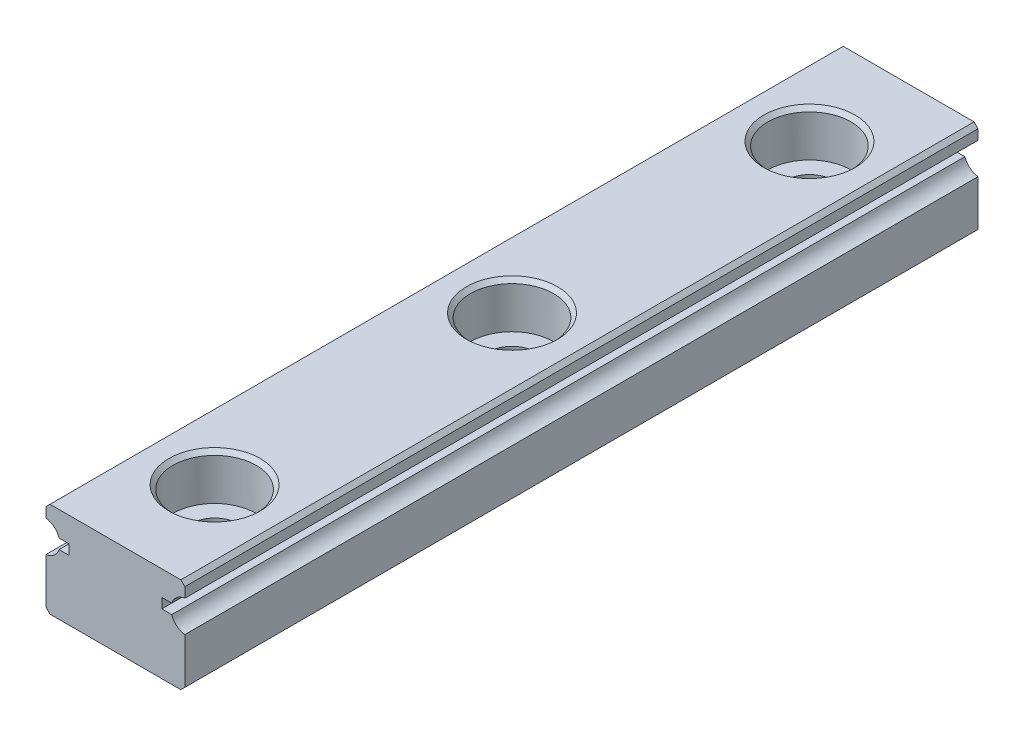
ISO-10303-21;
HEADER;
FILE_DESCRIPTION(('STEP AP214'),'2;1');
FILE_NAME('part.step','',(''),(''),'','','');
FILE_SCHEMA(('AUTOMOTIVE_DESIGN { 1 0 10303 214 1 1 1 1 }'));
ENDSEC;
DATA;
#1=APPLICATION_CONTEXT('core data for automotive mechanical design processes');
#2=APPLICATION_PROTOCOL_DEFINITION('international standard','automotive_design',2000,#1);
#3=PRODUCT_CONTEXT('',#1,'mechanical');
#4=PRODUCT('Part','Part','',(#3));
#5=PRODUCT_RELATED_PRODUCT_CATEGORY('part','',(#4));
#6=PRODUCT_DEFINITION_FORMATION('','',#4);
#7=PRODUCT_DEFINITION_CONTEXT('part definition',#1,'design');
#8=PRODUCT_DEFINITION('design','',#6,#7);
#9=PRODUCT_DEFINITION_SHAPE('','',#8);
#10=(LENGTH_UNIT() NAMED_UNIT(*) SI_UNIT(.MILLI.,.METRE.));
#11=(NAMED_UNIT(*) PLANE_ANGLE_UNIT() SI_UNIT($,.RADIAN.));
#12=(NAMED_UNIT(*) SI_UNIT($,.STERADIAN.) SOLID_ANGLE_UNIT());
#13=UNCERTAINTY_MEASURE_WITH_UNIT(LENGTH_MEASURE(1.E-05),#10,'distance_accuracy_value','');
#14=(GEOMETRIC_REPRESENTATION_CONTEXT(3) GLOBAL_UNCERTAINTY_ASSIGNED_CONTEXT((#13)) GLOBAL_UNIT_ASSIGNED_CONTEXT((#10,
#11,#12)) REPRESENTATION_CONTEXT('',''));
#15=CARTESIAN_POINT('',(0.,0.,0.));
#16=DIRECTION('',(0.,0.,1.));
#17=DIRECTION('',(1.,0.,0.));
#18=AXIS2_PLACEMENT_3D('',#15,#16,#17);
#19=CARTESIAN_POINT('',(0.,-2.401,35.));
#20=DIRECTION('',(0.,1.,0.));
#21=DIRECTION('',(0.,0.,1.));
#22=AXIS2_PLACEMENT_3D('',#19,#20,#21);
#23=CYLINDRICAL_SURFACE('',#22,1.2);
#24=CARTESIAN_POINT('',(0.,-2.20000000000001,35.));
#25=DIRECTION('',(0.,1.,0.));
#26=DIRECTION('',(0.,0.,1.));
#27=AXIS2_PLACEMENT_3D('',#24,#25,#26);
#28=CIRCLE('',#27,1.2);
#29=CARTESIAN_POINT('',(0.,-2.20000000000001,36.2));
#30=VERTEX_POINT('',#29);
#31=EDGE_CURVE('E318',#30,#30,#28,.F.);
#32=ORIENTED_EDGE('',*,*,#31,.T.);
#33=EDGE_LOOP('',(#32));
#34=FACE_BOUND('',#33,.T.);
#35=CARTESIAN_POINT('',(0.,0.0999999999999994,35.));
#36=DIRECTION('',(0.,1.,0.));
#37=DIRECTION('',(0.,0.,1.));
#38=AXIS2_PLACEMENT_3D('',#35,#36,#37);
#39=CIRCLE('',#38,1.2);
#40=CARTESIAN_POINT('',(0.,0.0999999999999994,36.2));
#41=VERTEX_POINT('',#40);
#42=EDGE_CURVE('E566',#41,#41,#39,.T.);
#43=ORIENTED_EDGE('',*,*,#42,.T.);
#44=EDGE_LOOP('',(#43));
#45=FACE_BOUND('',#44,.T.);
#46=ADVANCED_FACE('F34',(#34,#45),#23,.F.);
#47=CARTESIAN_POINT('',(0.,-2.401,20.));
#48=DIRECTION('',(0.,1.,0.));
#49=DIRECTION('',(0.,0.,1.));
#50=AXIS2_PLACEMENT_3D('',#47,#48,#49);
#51=CYLINDRICAL_SURFACE('',#50,1.2);
#52=CARTESIAN_POINT('',(0.,-2.20000000000001,20.));
#53=DIRECTION('',(0.,1.,0.));
#54=DIRECTION('',(0.,0.,1.));
#55=AXIS2_PLACEMENT_3D('',#52,#53,#54);
#56=CIRCLE('',#55,1.2);
#57=CARTESIAN_POINT('',(0.,-2.20000000000001,21.2));
#58=VERTEX_POINT('',#57);
#59=EDGE_CURVE('E306',#58,#58,#56,.F.);
#60=ORIENTED_EDGE('',*,*,#59,.T.);
#61=EDGE_LOOP('',(#60));
#62=FACE_BOUND('',#61,.T.);
#63=CARTESIAN_POINT('',(0.,0.0999999999999994,20.));
#64=DIRECTION('',(0.,1.,0.));
#65=DIRECTION('',(0.,0.,1.));
#66=AXIS2_PLACEMENT_3D('',#63,#64,#65);
#67=CIRCLE('',#66,1.2);
#68=CARTESIAN_POINT('',(0.,0.0999999999999994,21.2));
#69=VERTEX_POINT('',#68);
#70=EDGE_CURVE('E474',#69,#69,#67,.T.);
#71=ORIENTED_EDGE('',*,*,#70,.T.);
#72=EDGE_LOOP('',(#71));
#73=FACE_BOUND('',#72,.T.);
#74=ADVANCED_FACE('F339',(#62,#73),#51,.F.);
#75=CARTESIAN_POINT('',(0.,-2.401,5.));
#76=DIRECTION('',(0.,1.,0.));
#77=DIRECTION('',(0.,0.,1.));
#78=AXIS2_PLACEMENT_3D('',#75,#76,#77);
#79=CYLINDRICAL_SURFACE('',#78,1.2);
#80=CARTESIAN_POINT('',(0.,-2.20000000000001,5.));
#81=DIRECTION('',(0.,1.,0.));
#82=DIRECTION('',(0.,0.,1.));
#83=AXIS2_PLACEMENT_3D('',#80,#81,#82);
#84=CIRCLE('',#83,1.2);
#85=CARTESIAN_POINT('',(0.,-2.20000000000001,6.2));
#86=VERTEX_POINT('',#85);
#87=EDGE_CURVE('E294',#86,#86,#84,.F.);
#88=ORIENTED_EDGE('',*,*,#87,.T.);
#89=EDGE_LOOP('',(#88));
#90=FACE_BOUND('',#89,.T.);
#91=CARTESIAN_POINT('',(0.,0.0999999999999994,5.));
#92=DIRECTION('',(0.,1.,0.));
#93=DIRECTION('',(0.,0.,1.));
#94=AXIS2_PLACEMENT_3D('',#91,#92,#93);
#95=CIRCLE('',#94,1.2);
#96=CARTESIAN_POINT('',(0.,0.0999999999999994,6.2));
#97=VERTEX_POINT('',#96);
#98=EDGE_CURVE('E473',#97,#97,#95,.T.);
#99=ORIENTED_EDGE('',*,*,#98,.T.);
#100=EDGE_LOOP('',(#99));
#101=FACE_BOUND('',#100,.T.);
#102=ADVANCED_FACE('F345',(#90,#101),#79,.F.);
#103=CARTESIAN_POINT('',(-3.6,0.899999999999999,40.));
#104=DIRECTION('',(0.,0.,-1.));
#105=DIRECTION('',(-1.,0.,0.));
#106=AXIS2_PLACEMENT_3D('',#103,#104,#105);
#107=CYLINDRICAL_SURFACE('',#106,0.800000000000001);
#108=CARTESIAN_POINT('',(-3.6,0.899999999999999,0.));
#109=DIRECTION('',(0.,0.,-1.));
#110=DIRECTION('',(-1.,0.,0.));
#111=AXIS2_PLACEMENT_3D('',#108,#109,#110);
#112=CIRCLE('',#111,0.800000000000001);
#113=CARTESIAN_POINT('',(-3.5,1.69372539331938,0.));
#114=VERTEX_POINT('',#113);
#115=CARTESIAN_POINT('',(-2.84006579232147,1.15,0.));
#116=VERTEX_POINT('',#115);
#117=EDGE_CURVE('E204',#114,#116,#112,.T.);
#118=ORIENTED_EDGE('',*,*,#117,.T.);
#119=DIRECTION('',(0.,0.,-1.));
#120=VECTOR('',#119,1.);
#121=CARTESIAN_POINT('',(-2.84006579232147,1.15,40.));
#122=LINE('',#121,#120);
#123=CARTESIAN_POINT('',(-2.84006579232147,1.15,40.));
#124=VERTEX_POINT('',#123);
#125=EDGE_CURVE('E292',#124,#116,#122,.T.);
#126=ORIENTED_EDGE('',*,*,#125,.F.);
#127=CARTESIAN_POINT('',(-3.6,0.899999999999999,40.));
#128=DIRECTION('',(0.,0.,-1.));
#129=DIRECTION('',(-1.,0.,0.));
#130=AXIS2_PLACEMENT_3D('',#127,#128,#129);
#131=CIRCLE('',#130,0.800000000000001);
#132=CARTESIAN_POINT('',(-3.5,1.69372539331938,40.));
#133=VERTEX_POINT('',#132);
#134=EDGE_CURVE('E243',#133,#124,#131,.T.);
#135=ORIENTED_EDGE('',*,*,#134,.F.);
#136=DIRECTION('',(0.,0.,-1.));
#137=VECTOR('',#136,1.);
#138=CARTESIAN_POINT('',(-3.5,1.69372539331938,40.));
#139=LINE('',#138,#137);
#140=EDGE_CURVE('E200',#133,#114,#139,.T.);
#141=ORIENTED_EDGE('',*,*,#140,.T.);
#142=EDGE_LOOP('',(#118,#126,#135,#141));
#143=FACE_BOUND('',#142,.T.);
#144=ADVANCED_FACE('F365',(#143),#107,.F.);
#145=CARTESIAN_POINT('',(-2.84006579232147,1.15,40.));
#146=DIRECTION('',(0.,1.,0.));
#147=DIRECTION('',(-1.,0.,0.));
#148=AXIS2_PLACEMENT_3D('',#145,#146,#147);
#149=PLANE('',#148);
#150=DIRECTION('',(1.,0.,0.));
#151=VECTOR('',#150,1.);
#152=CARTESIAN_POINT('',(-2.84006579232147,1.15,0.));
#153=LINE('',#152,#151);
#154=CARTESIAN_POINT('',(-2.34006579232147,1.15,0.));
#155=VERTEX_POINT('',#154);
#156=EDGE_CURVE('E207',#116,#155,#153,.T.);
#157=ORIENTED_EDGE('',*,*,#156,.T.);
#158=DIRECTION('',(0.,0.,-1.));
#159=VECTOR('',#158,1.);
#160=CARTESIAN_POINT('',(-2.34006579232147,1.15,40.));
#161=LINE('',#160,#159);
#162=CARTESIAN_POINT('',(-2.34006579232147,1.15,40.));
#163=VERTEX_POINT('',#162);
#164=EDGE_CURVE('E289',#163,#155,#161,.T.);
#165=ORIENTED_EDGE('',*,*,#164,.F.);
#166=DIRECTION('',(1.,0.,0.));
#167=VECTOR('',#166,1.);
#168=CARTESIAN_POINT('',(-2.84006579232147,1.15,40.));
#169=LINE('',#168,#167);
#170=EDGE_CURVE('E131',#124,#163,#169,.T.);
#171=ORIENTED_EDGE('',*,*,#170,.F.);
#172=ORIENTED_EDGE('',*,*,#125,.T.);
#173=EDGE_LOOP('',(#157,#165,#171,#172));
#174=FACE_BOUND('',#173,.T.);
#175=ADVANCED_FACE('F439',(#174),#149,.F.);
#176=CARTESIAN_POINT('',(-2.34006579232147,0.649999999999998,40.));
#177=DIRECTION('',(1.,0.,0.));
#178=DIRECTION('',(0.,0.,-1.));
#179=AXIS2_PLACEMENT_3D('',#176,#177,#178);
#180=PLANE('',#179);
#181=DIRECTION('',(0.,-1.,0.));
#182=VECTOR('',#181,1.);
#183=CARTESIAN_POINT('',(-2.34006579232147,0.649999999999998,0.));
#184=LINE('',#183,#182);
#185=CARTESIAN_POINT('',(-2.34006579232147,0.649999999999998,0.));
#186=VERTEX_POINT('',#185);
#187=EDGE_CURVE('E210',#155,#186,#184,.T.);
#188=ORIENTED_EDGE('',*,*,#187,.T.);
#189=DIRECTION('',(0.,0.,-1.));
#190=VECTOR('',#189,1.);
#191=CARTESIAN_POINT('',(-2.34006579232147,0.649999999999998,40.));
#192=LINE('',#191,#190);
#193=CARTESIAN_POINT('',(-2.34006579232147,0.649999999999998,40.));
#194=VERTEX_POINT('',#193);
#195=EDGE_CURVE('E286',#194,#186,#192,.T.);
#196=ORIENTED_EDGE('',*,*,#195,.F.);
#197=DIRECTION('',(0.,-1.,0.));
#198=VECTOR('',#197,1.);
#199=CARTESIAN_POINT('',(-2.34006579232147,0.649999999999998,40.));
#200=LINE('',#199,#198);
#201=EDGE_CURVE('E487',#163,#194,#200,.T.);
#202=ORIENTED_EDGE('',*,*,#201,.F.);
#203=ORIENTED_EDGE('',*,*,#164,.T.);
#204=EDGE_LOOP('',(#188,#196,#202,#203));
#205=FACE_BOUND('',#204,.T.);
#206=ADVANCED_FACE('F435',(#205),#180,.F.);
#207=CARTESIAN_POINT('',(-2.84006579232147,0.649999999999999,40.));
#208=DIRECTION('',(0.,-1.,0.));
#209=DIRECTION('',(1.,0.,0.));
#210=AXIS2_PLACEMENT_3D('',#207,#208,#209);
#211=PLANE('',#210);
#212=DIRECTION('',(-1.,0.,0.));
#213=VECTOR('',#212,1.);
#214=CARTESIAN_POINT('',(-2.84006579232147,0.649999999999999,0.));
#215=LINE('',#214,#213);
#216=CARTESIAN_POINT('',(-2.84006579232147,0.65,0.));
#217=VERTEX_POINT('',#216);
#218=EDGE_CURVE('E212',#186,#217,#215,.T.);
#219=ORIENTED_EDGE('',*,*,#218,.T.);
#220=DIRECTION('',(0.,0.,-1.));
#221=VECTOR('',#220,1.);
#222=CARTESIAN_POINT('',(-2.84006579232147,0.65,40.));
#223=LINE('',#222,#221);
#224=CARTESIAN_POINT('',(-2.84006579232147,0.65,40.));
#225=VERTEX_POINT('',#224);
#226=EDGE_CURVE('E283',#225,#217,#223,.T.);
#227=ORIENTED_EDGE('',*,*,#226,.F.);
#228=DIRECTION('',(-1.,0.,0.));
#229=VECTOR('',#228,1.);
#230=CARTESIAN_POINT('',(-2.84006579232147,0.649999999999999,40.));
#231=LINE('',#230,#229);
#232=EDGE_CURVE('E489',#194,#225,#231,.T.);
#233=ORIENTED_EDGE('',*,*,#232,.F.);
#234=ORIENTED_EDGE('',*,*,#195,.T.);
#235=EDGE_LOOP('',(#219,#227,#233,#234));
#236=FACE_BOUND('',#235,.T.);
#237=ADVANCED_FACE('F431',(#236),#211,.F.);
#238=CARTESIAN_POINT('',(-3.6,0.899999999999999,40.));
#239=DIRECTION('',(0.,0.,-1.));
#240=DIRECTION('',(-1.,0.,0.));
#241=AXIS2_PLACEMENT_3D('',#238,#239,#240);
#242=CYLINDRICAL_SURFACE('',#241,0.800000000000001);
#243=CARTESIAN_POINT('',(-3.6,0.899999999999999,0.));
#244=DIRECTION('',(0.,0.,-1.));
#245=DIRECTION('',(-1.,0.,0.));
#246=AXIS2_PLACEMENT_3D('',#243,#244,#245);
#247=CIRCLE('',#246,0.800000000000001);
#248=CARTESIAN_POINT('',(-3.5,0.106274606680622,0.));
#249=VERTEX_POINT('',#248);
#250=EDGE_CURVE('E214',#217,#249,#247,.T.);
#251=ORIENTED_EDGE('',*,*,#250,.T.);
#252=DIRECTION('',(0.,0.,-1.));
#253=VECTOR('',#252,1.);
#254=CARTESIAN_POINT('',(-3.5,0.106274606680622,40.));
#255=LINE('',#254,#253);
#256=CARTESIAN_POINT('',(-3.5,0.106274606680622,40.));
#257=VERTEX_POINT('',#256);
#258=EDGE_CURVE('E280',#257,#249,#255,.T.);
#259=ORIENTED_EDGE('',*,*,#258,.F.);
#260=CARTESIAN_POINT('',(-3.6,0.899999999999999,40.));
#261=DIRECTION('',(0.,0.,-1.));
#262=DIRECTION('',(-1.,0.,0.));
#263=AXIS2_PLACEMENT_3D('',#260,#261,#262);
#264=CIRCLE('',#263,0.800000000000001);
#265=EDGE_CURVE('E491',#225,#257,#264,.T.);
#266=ORIENTED_EDGE('',*,*,#265,.F.);
#267=ORIENTED_EDGE('',*,*,#226,.T.);
#268=EDGE_LOOP('',(#251,#259,#266,#267));
#269=FACE_BOUND('',#268,.T.);
#270=ADVANCED_FACE('F427',(#269),#242,.F.);
#271=CARTESIAN_POINT('',(-3.5,-2.2,40.));
#272=DIRECTION('',(1.,0.,0.));
#273=DIRECTION('',(0.,1.,0.));
#274=AXIS2_PLACEMENT_3D('',#271,#272,#273);
#275=PLANE('',#274);
#276=DIRECTION('',(0.,-1.,0.));
#277=VECTOR('',#276,1.);
#278=CARTESIAN_POINT('',(-3.5,-2.2,0.));
#279=LINE('',#278,#277);
#280=CARTESIAN_POINT('',(-3.5,-2.2,0.));
#281=VERTEX_POINT('',#280);
#282=EDGE_CURVE('E216',#249,#281,#279,.T.);
#283=ORIENTED_EDGE('',*,*,#282,.T.);
#284=DIRECTION('',(0.,0.,-1.));
#285=VECTOR('',#284,1.);
#286=CARTESIAN_POINT('',(-3.5,-2.2,40.));
#287=LINE('',#286,#285);
#288=CARTESIAN_POINT('',(-3.5,-2.2,40.));
#289=VERTEX_POINT('',#288);
#290=EDGE_CURVE('E277',#289,#281,#287,.T.);
#291=ORIENTED_EDGE('',*,*,#290,.F.);
#292=DIRECTION('',(0.,-1.,0.));
#293=VECTOR('',#292,1.);
#294=CARTESIAN_POINT('',(-3.5,-2.2,40.));
#295=LINE('',#294,#293);
#296=EDGE_CURVE('E493',#257,#289,#295,.T.);
#297=ORIENTED_EDGE('',*,*,#296,.F.);
#298=ORIENTED_EDGE('',*,*,#258,.T.);
#299=EDGE_LOOP('',(#283,#291,#297,#298));
#300=FACE_BOUND('',#299,.T.);
#301=ADVANCED_FACE('F423',(#300),#275,.F.);
#302=CARTESIAN_POINT('',(-3.5,-2.2,40.));
#303=DIRECTION('',(0.707106781186548,0.707106781186548,0.));
#304=DIRECTION('',(-0.707106781186548,0.707106781186548,0.));
#305=AXIS2_PLACEMENT_3D('',#302,#303,#304);
#306=PLANE('',#305);
#307=DIRECTION('',(0.707106781186548,-0.707106781186548,0.));
#308=VECTOR('',#307,1.);
#309=CARTESIAN_POINT('',(-3.5,-2.2,0.));
#310=LINE('',#309,#308);
#311=CARTESIAN_POINT('',(-3.3,-2.4,0.));
#312=VERTEX_POINT('',#311);
#313=EDGE_CURVE('E218',#281,#312,#310,.T.);
#314=ORIENTED_EDGE('',*,*,#313,.T.);
#315=DIRECTION('',(0.,0.,-1.));
#316=VECTOR('',#315,1.);
#317=CARTESIAN_POINT('',(-3.3,-2.4,40.));
#318=LINE('',#317,#316);
#319=CARTESIAN_POINT('',(-3.3,-2.4,40.));
#320=VERTEX_POINT('',#319);
#321=EDGE_CURVE('E274',#320,#312,#318,.T.);
#322=ORIENTED_EDGE('',*,*,#321,.F.);
#323=DIRECTION('',(0.707106781186548,-0.707106781186548,0.));
#324=VECTOR('',#323,1.);
#325=CARTESIAN_POINT('',(-3.5,-2.2,40.));
#326=LINE('',#325,#324);
#327=EDGE_CURVE('E495',#289,#320,#326,.T.);
#328=ORIENTED_EDGE('',*,*,#327,.F.);
#329=ORIENTED_EDGE('',*,*,#290,.T.);
#330=EDGE_LOOP('',(#314,#322,#328,#329));
#331=FACE_BOUND('',#330,.T.);
#332=ADVANCED_FACE('F419',(#331),#306,.F.);
#333=CARTESIAN_POINT('',(-3.3,-2.4,40.));
#334=DIRECTION('',(0.,1.,0.));
#335=DIRECTION('',(0.,0.,1.));
#336=AXIS2_PLACEMENT_3D('',#333,#334,#335);
#337=PLANE('',#336);
#338=CARTESIAN_POINT('',(0.,-2.4,35.));
#339=DIRECTION('',(0.,1.,0.));
#340=DIRECTION('',(0.,0.,1.));
#341=AXIS2_PLACEMENT_3D('',#338,#339,#340);
#342=CIRCLE('',#341,1.39999999999998);
#343=CARTESIAN_POINT('',(0.,-2.4,36.4));
#344=VERTEX_POINT('',#343);
#345=EDGE_CURVE('E321',#344,#344,#342,.T.);
#346=ORIENTED_EDGE('',*,*,#345,.T.);
#347=EDGE_LOOP('',(#346));
#348=FACE_BOUND('',#347,.T.);
#349=CARTESIAN_POINT('',(0.,-2.4,20.));
#350=DIRECTION('',(0.,1.,0.));
#351=DIRECTION('',(0.,0.,1.));
#352=AXIS2_PLACEMENT_3D('',#349,#350,#351);
#353=CIRCLE('',#352,1.39999999999999);
#354=CARTESIAN_POINT('',(0.,-2.4,21.4));
#355=VERTEX_POINT('',#354);
#356=EDGE_CURVE('E309',#355,#355,#353,.T.);
#357=ORIENTED_EDGE('',*,*,#356,.T.);
#358=EDGE_LOOP('',(#357));
#359=FACE_BOUND('',#358,.T.);
#360=CARTESIAN_POINT('',(0.,-2.4,5.));
#361=DIRECTION('',(0.,1.,0.));
#362=DIRECTION('',(0.,0.,1.));
#363=AXIS2_PLACEMENT_3D('',#360,#361,#362);
#364=CIRCLE('',#363,1.39999999999999);
#365=CARTESIAN_POINT('',(0.,-2.4,6.39999999999999));
#366=VERTEX_POINT('',#365);
#367=EDGE_CURVE('E297',#366,#366,#364,.T.);
#368=ORIENTED_EDGE('',*,*,#367,.T.);
#369=EDGE_LOOP('',(#368));
#370=FACE_BOUND('',#369,.T.);
#371=DIRECTION('',(1.,0.,0.));
#372=VECTOR('',#371,1.);
#373=CARTESIAN_POINT('',(-3.3,-2.4,0.));
#374=LINE('',#373,#372);
#375=CARTESIAN_POINT('',(3.3,-2.4,0.));
#376=VERTEX_POINT('',#375);
#377=EDGE_CURVE('E220',#312,#376,#374,.T.);
#378=ORIENTED_EDGE('',*,*,#377,.T.);
#379=DIRECTION('',(0.,0.,-1.));
#380=VECTOR('',#379,1.);
#381=CARTESIAN_POINT('',(3.3,-2.4,40.));
#382=LINE('',#381,#380);
#383=CARTESIAN_POINT('',(3.3,-2.4,40.));
#384=VERTEX_POINT('',#383);
#385=EDGE_CURVE('E271',#384,#376,#382,.T.);
#386=ORIENTED_EDGE('',*,*,#385,.F.);
#387=DIRECTION('',(1.,0.,0.));
#388=VECTOR('',#387,1.);
#389=CARTESIAN_POINT('',(-3.3,-2.4,40.));
#390=LINE('',#389,#388);
#391=EDGE_CURVE('E497',#320,#384,#390,.T.);
#392=ORIENTED_EDGE('',*,*,#391,.F.);
#393=ORIENTED_EDGE('',*,*,#321,.T.);
#394=EDGE_LOOP('',(#378,#386,#392,#393));
#395=FACE_BOUND('',#394,.T.);
#396=ADVANCED_FACE('F415',(#348,#359,#370,#395),#337,.F.);
#397=CARTESIAN_POINT('',(3.3,-2.4,40.));
#398=DIRECTION('',(-0.707106781186548,0.707106781186548,0.));
#399=DIRECTION('',(-0.707106781186548,-0.707106781186548,0.));
#400=AXIS2_PLACEMENT_3D('',#397,#398,#399);
#401=PLANE('',#400);
#402=DIRECTION('',(0.707106781186548,0.707106781186548,0.));
#403=VECTOR('',#402,1.);
#404=CARTESIAN_POINT('',(3.3,-2.4,0.));
#405=LINE('',#404,#403);
#406=CARTESIAN_POINT('',(3.5,-2.2,0.));
#407=VERTEX_POINT('',#406);
#408=EDGE_CURVE('E222',#376,#407,#405,.T.);
#409=ORIENTED_EDGE('',*,*,#408,.T.);
#410=DIRECTION('',(0.,0.,-1.));
#411=VECTOR('',#410,1.);
#412=CARTESIAN_POINT('',(3.5,-2.2,40.));
#413=LINE('',#412,#411);
#414=CARTESIAN_POINT('',(3.5,-2.2,40.));
#415=VERTEX_POINT('',#414);
#416=EDGE_CURVE('E268',#415,#407,#413,.T.);
#417=ORIENTED_EDGE('',*,*,#416,.F.);
#418=DIRECTION('',(0.707106781186548,0.707106781186548,0.));
#419=VECTOR('',#418,1.);
#420=CARTESIAN_POINT('',(3.3,-2.4,40.));
#421=LINE('',#420,#419);
#422=EDGE_CURVE('E499',#384,#415,#421,.T.);
#423=ORIENTED_EDGE('',*,*,#422,.F.);
#424=ORIENTED_EDGE('',*,*,#385,.T.);
#425=EDGE_LOOP('',(#409,#417,#423,#424));
#426=FACE_BOUND('',#425,.T.);
#427=ADVANCED_FACE('F411',(#426),#401,.F.);
#428=CARTESIAN_POINT('',(3.5,-2.2,40.));
#429=DIRECTION('',(-1.,0.,0.));
#430=DIRECTION('',(0.,-1.,0.));
#431=AXIS2_PLACEMENT_3D('',#428,#429,#430);
#432=PLANE('',#431);
#433=DIRECTION('',(0.,1.,0.));
#434=VECTOR('',#433,1.);
#435=CARTESIAN_POINT('',(3.5,-2.2,0.));
#436=LINE('',#435,#434);
#437=CARTESIAN_POINT('',(3.5,0.106274606680621,0.));
#438=VERTEX_POINT('',#437);
#439=EDGE_CURVE('E224',#407,#438,#436,.T.);
#440=ORIENTED_EDGE('',*,*,#439,.T.);
#441=DIRECTION('',(0.,0.,-1.));
#442=VECTOR('',#441,1.);
#443=CARTESIAN_POINT('',(3.5,0.106274606680621,40.));
#444=LINE('',#443,#442);
#445=CARTESIAN_POINT('',(3.5,0.106274606680621,40.));
#446=VERTEX_POINT('',#445);
#447=EDGE_CURVE('E265',#446,#438,#444,.T.);
#448=ORIENTED_EDGE('',*,*,#447,.F.);
#449=DIRECTION('',(0.,1.,0.));
#450=VECTOR('',#449,1.);
#451=CARTESIAN_POINT('',(3.5,-2.2,40.));
#452=LINE('',#451,#450);
#453=EDGE_CURVE('E501',#415,#446,#452,.T.);
#454=ORIENTED_EDGE('',*,*,#453,.F.);
#455=ORIENTED_EDGE('',*,*,#416,.T.);
#456=EDGE_LOOP('',(#440,#448,#454,#455));
#457=FACE_BOUND('',#456,.T.);
#458=ADVANCED_FACE('F407',(#457),#432,.F.);
#459=CARTESIAN_POINT('',(3.6,0.899999999999999,40.));
#460=DIRECTION('',(0.,0.,-1.));
#461=DIRECTION('',(-1.,0.,0.));
#462=AXIS2_PLACEMENT_3D('',#459,#460,#461);
#463=CYLINDRICAL_SURFACE('',#462,0.800000000000001);
#464=CARTESIAN_POINT('',(3.6,0.899999999999999,0.));
#465=DIRECTION('',(0.,0.,-1.));
#466=DIRECTION('',(1.,0.,0.));
#467=AXIS2_PLACEMENT_3D('',#464,#465,#466);
#468=CIRCLE('',#467,0.800000000000001);
#469=CARTESIAN_POINT('',(2.84006579232146,0.649999999999999,0.));
#470=VERTEX_POINT('',#469);
#471=EDGE_CURVE('E226',#438,#470,#468,.T.);
#472=ORIENTED_EDGE('',*,*,#471,.T.);
#473=DIRECTION('',(0.,0.,-1.));
#474=VECTOR('',#473,1.);
#475=CARTESIAN_POINT('',(2.84006579232146,0.649999999999999,40.));
#476=LINE('',#475,#474);
#477=CARTESIAN_POINT('',(2.84006579232146,0.649999999999999,40.));
#478=VERTEX_POINT('',#477);
#479=EDGE_CURVE('E262',#478,#470,#476,.T.);
#480=ORIENTED_EDGE('',*,*,#479,.F.);
#481=CARTESIAN_POINT('',(3.6,0.899999999999999,40.));
#482=DIRECTION('',(0.,0.,-1.));
#483=DIRECTION('',(1.,0.,0.));
#484=AXIS2_PLACEMENT_3D('',#481,#482,#483);
#485=CIRCLE('',#484,0.800000000000001);
#486=EDGE_CURVE('E503',#446,#478,#485,.T.);
#487=ORIENTED_EDGE('',*,*,#486,.F.);
#488=ORIENTED_EDGE('',*,*,#447,.T.);
#489=EDGE_LOOP('',(#472,#480,#487,#488));
#490=FACE_BOUND('',#489,.T.);
#491=ADVANCED_FACE('F403',(#490),#463,.F.);
#492=CARTESIAN_POINT('',(2.84006579232146,0.649999999999999,40.));
#493=DIRECTION('',(0.,-1.,0.));
#494=DIRECTION('',(1.,0.,0.));
#495=AXIS2_PLACEMENT_3D('',#492,#493,#494);
#496=PLANE('',#495);
#497=DIRECTION('',(-1.,0.,0.));
#498=VECTOR('',#497,1.);
#499=CARTESIAN_POINT('',(2.84006579232146,0.649999999999999,0.));
#500=LINE('',#499,#498);
#501=CARTESIAN_POINT('',(2.34006579232147,0.649999999999998,0.));
#502=VERTEX_POINT('',#501);
#503=EDGE_CURVE('E228',#470,#502,#500,.T.);
#504=ORIENTED_EDGE('',*,*,#503,.T.);
#505=DIRECTION('',(0.,0.,-1.));
#506=VECTOR('',#505,1.);
#507=CARTESIAN_POINT('',(2.34006579232147,0.649999999999998,40.));
#508=LINE('',#507,#506);
#509=CARTESIAN_POINT('',(2.34006579232147,0.649999999999998,40.));
#510=VERTEX_POINT('',#509);
#511=EDGE_CURVE('E259',#510,#502,#508,.T.);
#512=ORIENTED_EDGE('',*,*,#511,.F.);
#513=DIRECTION('',(-1.,0.,0.));
#514=VECTOR('',#513,1.);
#515=CARTESIAN_POINT('',(2.84006579232146,0.649999999999999,40.));
#516=LINE('',#515,#514);
#517=EDGE_CURVE('E505',#478,#510,#516,.T.);
#518=ORIENTED_EDGE('',*,*,#517,.F.);
#519=ORIENTED_EDGE('',*,*,#479,.T.);
#520=EDGE_LOOP('',(#504,#512,#518,#519));
#521=FACE_BOUND('',#520,.T.);
#522=ADVANCED_FACE('F399',(#521),#496,.F.);
#523=CARTESIAN_POINT('',(2.34006579232147,0.649999999999998,40.));
#524=DIRECTION('',(-1.,0.,0.));
#525=DIRECTION('',(0.,0.,1.));
#526=AXIS2_PLACEMENT_3D('',#523,#524,#525);
#527=PLANE('',#526);
#528=DIRECTION('',(0.,1.,0.));
#529=VECTOR('',#528,1.);
#530=CARTESIAN_POINT('',(2.34006579232147,0.649999999999998,0.));
#531=LINE('',#530,#529);
#532=CARTESIAN_POINT('',(2.34006579232147,1.15,0.));
#533=VERTEX_POINT('',#532);
#534=EDGE_CURVE('E230',#502,#533,#531,.T.);
#535=ORIENTED_EDGE('',*,*,#534,.T.);
#536=DIRECTION('',(0.,0.,-1.));
#537=VECTOR('',#536,1.);
#538=CARTESIAN_POINT('',(2.34006579232147,1.15,40.));
#539=LINE('',#538,#537);
#540=CARTESIAN_POINT('',(2.34006579232147,1.15,40.));
#541=VERTEX_POINT('',#540);
#542=EDGE_CURVE('E256',#541,#533,#539,.T.);
#543=ORIENTED_EDGE('',*,*,#542,.F.);
#544=DIRECTION('',(0.,1.,0.));
#545=VECTOR('',#544,1.);
#546=CARTESIAN_POINT('',(2.34006579232147,0.649999999999998,40.));
#547=LINE('',#546,#545);
#548=EDGE_CURVE('E507',#510,#541,#547,.T.);
#549=ORIENTED_EDGE('',*,*,#548,.F.);
#550=ORIENTED_EDGE('',*,*,#511,.T.);
#551=EDGE_LOOP('',(#535,#543,#549,#550));
#552=FACE_BOUND('',#551,.T.);
#553=ADVANCED_FACE('F395',(#552),#527,.F.);
#554=CARTESIAN_POINT('',(2.84006579232146,1.15,40.));
#555=DIRECTION('',(0.,1.,0.));
#556=DIRECTION('',(-1.,0.,0.));
#557=AXIS2_PLACEMENT_3D('',#554,#555,#556);
#558=PLANE('',#557);
#559=DIRECTION('',(1.,0.,0.));
#560=VECTOR('',#559,1.);
#561=CARTESIAN_POINT('',(2.84006579232146,1.15,0.));
#562=LINE('',#561,#560);
#563=CARTESIAN_POINT('',(2.84006579232147,1.15,0.));
#564=VERTEX_POINT('',#563);
#565=EDGE_CURVE('E232',#533,#564,#562,.T.);
#566=ORIENTED_EDGE('',*,*,#565,.T.);
#567=DIRECTION('',(0.,0.,-1.));
#568=VECTOR('',#567,1.);
#569=CARTESIAN_POINT('',(2.84006579232147,1.15,40.));
#570=LINE('',#569,#568);
#571=CARTESIAN_POINT('',(2.84006579232147,1.15,40.));
#572=VERTEX_POINT('',#571);
#573=EDGE_CURVE('E253',#572,#564,#570,.T.);
#574=ORIENTED_EDGE('',*,*,#573,.F.);
#575=DIRECTION('',(1.,0.,0.));
#576=VECTOR('',#575,1.);
#577=CARTESIAN_POINT('',(2.84006579232146,1.15,40.));
#578=LINE('',#577,#576);
#579=EDGE_CURVE('E509',#541,#572,#578,.T.);
#580=ORIENTED_EDGE('',*,*,#579,.F.);
#581=ORIENTED_EDGE('',*,*,#542,.T.);
#582=EDGE_LOOP('',(#566,#574,#580,#581));
#583=FACE_BOUND('',#582,.T.);
#584=ADVANCED_FACE('F391',(#583),#558,.F.);
#585=CARTESIAN_POINT('',(3.6,0.899999999999999,40.));
#586=DIRECTION('',(0.,0.,-1.));
#587=DIRECTION('',(-1.,0.,0.));
#588=AXIS2_PLACEMENT_3D('',#585,#586,#587);
#589=CYLINDRICAL_SURFACE('',#588,0.800000000000001);
#590=CARTESIAN_POINT('',(3.6,0.899999999999999,0.));
#591=DIRECTION('',(0.,0.,-1.));
#592=DIRECTION('',(1.,0.,0.));
#593=AXIS2_PLACEMENT_3D('',#590,#591,#592);
#594=CIRCLE('',#593,0.800000000000001);
#595=CARTESIAN_POINT('',(3.5,1.69372539331938,0.));
#596=VERTEX_POINT('',#595);
#597=EDGE_CURVE('E234',#564,#596,#594,.T.);
#598=ORIENTED_EDGE('',*,*,#597,.T.);
#599=DIRECTION('',(0.,0.,-1.));
#600=VECTOR('',#599,1.);
#601=CARTESIAN_POINT('',(3.5,1.69372539331938,40.));
#602=LINE('',#601,#600);
#603=CARTESIAN_POINT('',(3.5,1.69372539331938,40.));
#604=VERTEX_POINT('',#603);
#605=EDGE_CURVE('E250',#604,#596,#602,.T.);
#606=ORIENTED_EDGE('',*,*,#605,.F.);
#607=CARTESIAN_POINT('',(3.6,0.899999999999999,40.));
#608=DIRECTION('',(0.,0.,-1.));
#609=DIRECTION('',(1.,0.,0.));
#610=AXIS2_PLACEMENT_3D('',#607,#608,#609);
#611=CIRCLE('',#610,0.800000000000001);
#612=EDGE_CURVE('E511',#572,#604,#611,.T.);
#613=ORIENTED_EDGE('',*,*,#612,.F.);
#614=ORIENTED_EDGE('',*,*,#573,.T.);
#615=EDGE_LOOP('',(#598,#606,#613,#614));
#616=FACE_BOUND('',#615,.T.);
#617=ADVANCED_FACE('F387',(#616),#589,.F.);
#618=CARTESIAN_POINT('',(3.5,1.69372539331938,40.));
#619=DIRECTION('',(-1.,0.,0.));
#620=DIRECTION('',(0.,-1.,0.));
#621=AXIS2_PLACEMENT_3D('',#618,#619,#620);
#622=PLANE('',#621);
#623=DIRECTION('',(0.,1.,0.));
#624=VECTOR('',#623,1.);
#625=CARTESIAN_POINT('',(3.5,1.69372539331938,0.));
#626=LINE('',#625,#624);
#627=CARTESIAN_POINT('',(3.5,2.2,0.));
#628=VERTEX_POINT('',#627);
#629=EDGE_CURVE('E236',#596,#628,#626,.T.);
#630=ORIENTED_EDGE('',*,*,#629,.T.);
#631=DIRECTION('',(0.,0.,-1.));
#632=VECTOR('',#631,1.);
#633=CARTESIAN_POINT('',(3.5,2.2,40.));
#634=LINE('',#633,#632);
#635=CARTESIAN_POINT('',(3.5,2.2,40.));
#636=VERTEX_POINT('',#635);
#637=EDGE_CURVE('E247',#636,#628,#634,.T.);
#638=ORIENTED_EDGE('',*,*,#637,.F.);
#639=DIRECTION('',(0.,1.,0.));
#640=VECTOR('',#639,1.);
#641=CARTESIAN_POINT('',(3.5,1.69372539331938,40.));
#642=LINE('',#641,#640);
#643=EDGE_CURVE('E513',#604,#636,#642,.T.);
#644=ORIENTED_EDGE('',*,*,#643,.F.);
#645=ORIENTED_EDGE('',*,*,#605,.T.);
#646=EDGE_LOOP('',(#630,#638,#644,#645));
#647=FACE_BOUND('',#646,.T.);
#648=ADVANCED_FACE('F383',(#647),#622,.F.);
#649=CARTESIAN_POINT('',(3.3,2.4,40.));
#650=DIRECTION('',(-0.707106781186547,-0.707106781186548,0.));
#651=DIRECTION('',(0.707106781186548,-0.707106781186547,0.));
#652=AXIS2_PLACEMENT_3D('',#649,#650,#651);
#653=PLANE('',#652);
#654=DIRECTION('',(-0.707106781186548,0.707106781186547,0.));
#655=VECTOR('',#654,1.);
#656=CARTESIAN_POINT('',(3.3,2.4,0.));
#657=LINE('',#656,#655);
#658=CARTESIAN_POINT('',(3.3,2.4,0.));
#659=VERTEX_POINT('',#658);
#660=EDGE_CURVE('E238',#628,#659,#657,.T.);
#661=ORIENTED_EDGE('',*,*,#660,.T.);
#662=DIRECTION('',(0.,0.,-1.));
#663=VECTOR('',#662,1.);
#664=CARTESIAN_POINT('',(3.3,2.4,40.));
#665=LINE('',#664,#663);
#666=CARTESIAN_POINT('',(3.3,2.4,40.));
#667=VERTEX_POINT('',#666);
#668=EDGE_CURVE('E195',#667,#659,#665,.T.);
#669=ORIENTED_EDGE('',*,*,#668,.F.);
#670=DIRECTION('',(-0.707106781186548,0.707106781186547,0.));
#671=VECTOR('',#670,1.);
#672=CARTESIAN_POINT('',(3.3,2.4,40.));
#673=LINE('',#672,#671);
#674=EDGE_CURVE('E186',#636,#667,#673,.T.);
#675=ORIENTED_EDGE('',*,*,#674,.F.);
#676=ORIENTED_EDGE('',*,*,#637,.T.);
#677=EDGE_LOOP('',(#661,#669,#675,#676));
#678=FACE_BOUND('',#677,.T.);
#679=ADVANCED_FACE('F379',(#678),#653,.F.);
#680=CARTESIAN_POINT('',(-3.3,2.4,40.));
#681=DIRECTION('',(0.,-1.,0.));
#682=DIRECTION('',(0.,0.,-1.));
#683=AXIS2_PLACEMENT_3D('',#680,#681,#682);
#684=PLANE('',#683);
#685=CARTESIAN_POINT('',(0.,2.4,35.));
#686=DIRECTION('',(0.,-1.,0.));
#687=DIRECTION('',(0.,0.,-1.));
#688=AXIS2_PLACEMENT_3D('',#685,#686,#687);
#689=CIRCLE('',#688,2.3);
#690=CARTESIAN_POINT('',(0.,2.4,32.7));
#691=VERTEX_POINT('',#690);
#692=EDGE_CURVE('E11',#691,#691,#689,.T.);
#693=ORIENTED_EDGE('',*,*,#692,.T.);
#694=EDGE_LOOP('',(#693));
#695=FACE_BOUND('',#694,.T.);
#696=CARTESIAN_POINT('',(0.,2.4,20.));
#697=DIRECTION('',(0.,-1.,0.));
#698=DIRECTION('',(0.,0.,-1.));
#699=AXIS2_PLACEMENT_3D('',#696,#697,#698);
#700=CIRCLE('',#699,2.3);
#701=CARTESIAN_POINT('',(0.,2.4,17.7));
#702=VERTEX_POINT('',#701);
#703=EDGE_CURVE('E315',#702,#702,#700,.T.);
#704=ORIENTED_EDGE('',*,*,#703,.T.);
#705=EDGE_LOOP('',(#704));
#706=FACE_BOUND('',#705,.T.);
#707=CARTESIAN_POINT('',(0.,2.4,5.));
#708=DIRECTION('',(0.,-1.,0.));
#709=DIRECTION('',(0.,0.,-1.));
#710=AXIS2_PLACEMENT_3D('',#707,#708,#709);
#711=CIRCLE('',#710,2.3);
#712=CARTESIAN_POINT('',(0.,2.4,2.7));
#713=VERTEX_POINT('',#712);
#714=EDGE_CURVE('E303',#713,#713,#711,.T.);
#715=ORIENTED_EDGE('',*,*,#714,.T.);
#716=EDGE_LOOP('',(#715));
#717=FACE_BOUND('',#716,.T.);
#718=DIRECTION('',(-1.,0.,0.));
#719=VECTOR('',#718,1.);
#720=CARTESIAN_POINT('',(-3.3,2.4,0.));
#721=LINE('',#720,#719);
#722=CARTESIAN_POINT('',(-3.3,2.4,0.));
#723=VERTEX_POINT('',#722);
#724=EDGE_CURVE('E194',#659,#723,#721,.T.);
#725=ORIENTED_EDGE('',*,*,#724,.T.);
#726=DIRECTION('',(0.,0.,-1.));
#727=VECTOR('',#726,1.);
#728=CARTESIAN_POINT('',(-3.3,2.4,40.));
#729=LINE('',#728,#727);
#730=CARTESIAN_POINT('',(-3.3,2.4,40.));
#731=VERTEX_POINT('',#730);
#732=EDGE_CURVE('E191',#731,#723,#729,.T.);
#733=ORIENTED_EDGE('',*,*,#732,.F.);
#734=DIRECTION('',(-1.,0.,0.));
#735=VECTOR('',#734,1.);
#736=CARTESIAN_POINT('',(-3.3,2.4,40.));
#737=LINE('',#736,#735);
#738=EDGE_CURVE('E180',#667,#731,#737,.T.);
#739=ORIENTED_EDGE('',*,*,#738,.F.);
#740=ORIENTED_EDGE('',*,*,#668,.T.);
#741=EDGE_LOOP('',(#725,#733,#739,#740));
#742=FACE_BOUND('',#741,.T.);
#743=ADVANCED_FACE('F192',(#695,#706,#717,#742),#684,.F.);
#744=CARTESIAN_POINT('',(-3.5,2.2,40.));
#745=DIRECTION('',(0.707106781186548,-0.707106781186548,0.));
#746=DIRECTION('',(0.707106781186548,0.707106781186548,0.));
#747=AXIS2_PLACEMENT_3D('',#744,#745,#746);
#748=PLANE('',#747);
#749=DIRECTION('',(-0.707106781186548,-0.707106781186548,0.));
#750=VECTOR('',#749,1.);
#751=CARTESIAN_POINT('',(-3.5,2.2,0.));
#752=LINE('',#751,#750);
#753=CARTESIAN_POINT('',(-3.5,2.2,0.));
#754=VERTEX_POINT('',#753);
#755=EDGE_CURVE('E116',#723,#754,#752,.T.);
#756=ORIENTED_EDGE('',*,*,#755,.T.);
#757=DIRECTION('',(0.,0.,-1.));
#758=VECTOR('',#757,1.);
#759=CARTESIAN_POINT('',(-3.5,2.2,40.));
#760=LINE('',#759,#758);
#761=CARTESIAN_POINT('',(-3.5,2.2,40.));
#762=VERTEX_POINT('',#761);
#763=EDGE_CURVE('E196',#762,#754,#760,.T.);
#764=ORIENTED_EDGE('',*,*,#763,.F.);
#765=DIRECTION('',(-0.707106781186548,-0.707106781186548,0.));
#766=VECTOR('',#765,1.);
#767=CARTESIAN_POINT('',(-3.5,2.2,40.));
#768=LINE('',#767,#766);
#769=EDGE_CURVE('E184',#731,#762,#768,.T.);
#770=ORIENTED_EDGE('',*,*,#769,.F.);
#771=ORIENTED_EDGE('',*,*,#732,.T.);
#772=EDGE_LOOP('',(#756,#764,#770,#771));
#773=FACE_BOUND('',#772,.T.);
#774=ADVANCED_FACE('F198',(#773),#748,.F.);
#775=CARTESIAN_POINT('',(-3.5,1.69372539331938,40.));
#776=DIRECTION('',(1.,0.,0.));
#777=DIRECTION('',(0.,1.,0.));
#778=AXIS2_PLACEMENT_3D('',#775,#776,#777);
#779=PLANE('',#778);
#780=DIRECTION('',(0.,-1.,0.));
#781=VECTOR('',#780,1.);
#782=CARTESIAN_POINT('',(-3.5,1.69372539331938,0.));
#783=LINE('',#782,#781);
#784=EDGE_CURVE('E122',#754,#114,#783,.T.);
#785=ORIENTED_EDGE('',*,*,#784,.T.);
#786=ORIENTED_EDGE('',*,*,#140,.F.);
#787=DIRECTION('',(0.,-1.,0.));
#788=VECTOR('',#787,1.);
#789=CARTESIAN_POINT('',(-3.5,1.69372539331938,40.));
#790=LINE('',#789,#788);
#791=EDGE_CURVE('E51',#762,#133,#790,.T.);
#792=ORIENTED_EDGE('',*,*,#791,.F.);
#793=ORIENTED_EDGE('',*,*,#763,.T.);
#794=EDGE_LOOP('',(#785,#786,#792,#793));
#795=FACE_BOUND('',#794,.T.);
#796=ADVANCED_FACE('F369',(#795),#779,.F.);
#797=CARTESIAN_POINT('',(-3.6,0.899999999999999,40.));
#798=DIRECTION('',(0.,0.,-1.));
#799=DIRECTION('',(-1.,0.,0.));
#800=AXIS2_PLACEMENT_3D('',#797,#798,#799);
#801=PLANE('',#800);
#802=ORIENTED_EDGE('',*,*,#134,.T.);
#803=ORIENTED_EDGE('',*,*,#170,.T.);
#804=ORIENTED_EDGE('',*,*,#201,.T.);
#805=ORIENTED_EDGE('',*,*,#232,.T.);
#806=ORIENTED_EDGE('',*,*,#265,.T.);
#807=ORIENTED_EDGE('',*,*,#296,.T.);
#808=ORIENTED_EDGE('',*,*,#327,.T.);
#809=ORIENTED_EDGE('',*,*,#391,.T.);
#810=ORIENTED_EDGE('',*,*,#422,.T.);
#811=ORIENTED_EDGE('',*,*,#453,.T.);
#812=ORIENTED_EDGE('',*,*,#486,.T.);
#813=ORIENTED_EDGE('',*,*,#517,.T.);
#814=ORIENTED_EDGE('',*,*,#548,.T.);
#815=ORIENTED_EDGE('',*,*,#579,.T.);
#816=ORIENTED_EDGE('',*,*,#612,.T.);
#817=ORIENTED_EDGE('',*,*,#643,.T.);
#818=ORIENTED_EDGE('',*,*,#674,.T.);
#819=ORIENTED_EDGE('',*,*,#738,.T.);
#820=ORIENTED_EDGE('',*,*,#769,.T.);
#821=ORIENTED_EDGE('',*,*,#791,.T.);
#822=EDGE_LOOP('',(#802,#803,#804,#805,#806,#807,#808,#809,#810,#811,#812,#813,#814,#815,#816,
#817,#818,#819,#820,#821));
#823=FACE_BOUND('',#822,.T.);
#824=ADVANCED_FACE('F182',(#823),#801,.F.);
#825=CARTESIAN_POINT('',(-3.6,0.899999999999999,0.));
#826=DIRECTION('',(0.,0.,-1.));
#827=DIRECTION('',(-1.,0.,0.));
#828=AXIS2_PLACEMENT_3D('',#825,#826,#827);
#829=PLANE('',#828);
#830=ORIENTED_EDGE('',*,*,#117,.F.);
#831=ORIENTED_EDGE('',*,*,#784,.F.);
#832=ORIENTED_EDGE('',*,*,#755,.F.);
#833=ORIENTED_EDGE('',*,*,#724,.F.);
#834=ORIENTED_EDGE('',*,*,#660,.F.);
#835=ORIENTED_EDGE('',*,*,#629,.F.);
#836=ORIENTED_EDGE('',*,*,#597,.F.);
#837=ORIENTED_EDGE('',*,*,#565,.F.);
#838=ORIENTED_EDGE('',*,*,#534,.F.);
#839=ORIENTED_EDGE('',*,*,#503,.F.);
#840=ORIENTED_EDGE('',*,*,#471,.F.);
#841=ORIENTED_EDGE('',*,*,#439,.F.);
#842=ORIENTED_EDGE('',*,*,#408,.F.);
#843=ORIENTED_EDGE('',*,*,#377,.F.);
#844=ORIENTED_EDGE('',*,*,#313,.F.);
#845=ORIENTED_EDGE('',*,*,#282,.F.);
#846=ORIENTED_EDGE('',*,*,#250,.F.);
#847=ORIENTED_EDGE('',*,*,#218,.F.);
#848=ORIENTED_EDGE('',*,*,#187,.F.);
#849=ORIENTED_EDGE('',*,*,#156,.F.);
#850=EDGE_LOOP('',(#830,#831,#832,#833,#834,#835,#836,#837,#838,#839,#840,#841,#842,#843,#844,
#845,#846,#847,#848,#849));
#851=FACE_BOUND('',#850,.T.);
#852=ADVANCED_FACE('F361',(#851),#829,.T.);
#853=CARTESIAN_POINT('',(0.,0.0999999999999994,5.));
#854=DIRECTION('',(0.,1.,0.));
#855=DIRECTION('',(0.,0.,1.));
#856=AXIS2_PLACEMENT_3D('',#853,#854,#855);
#857=CYLINDRICAL_SURFACE('',#856,2.1);
#858=CARTESIAN_POINT('',(0.,2.2,5.));
#859=DIRECTION('',(0.,-1.,0.));
#860=DIRECTION('',(0.,0.,-1.));
#861=AXIS2_PLACEMENT_3D('',#858,#859,#860);
#862=CIRCLE('',#861,2.1);
#863=CARTESIAN_POINT('',(0.,2.2,2.9));
#864=VERTEX_POINT('',#863);
#865=EDGE_CURVE('E300',#864,#864,#862,.F.);
#866=ORIENTED_EDGE('',*,*,#865,.T.);
#867=EDGE_LOOP('',(#866));
#868=FACE_BOUND('',#867,.T.);
#869=CARTESIAN_POINT('',(0.,0.0999999999999994,5.));
#870=DIRECTION('',(0.,1.,0.));
#871=DIRECTION('',(0.,0.,1.));
#872=AXIS2_PLACEMENT_3D('',#869,#870,#871);
#873=CIRCLE('',#872,2.1);
#874=CARTESIAN_POINT('',(0.,0.0999999999999994,7.1));
#875=VERTEX_POINT('',#874);
#876=EDGE_CURVE('E208',#875,#875,#873,.T.);
#877=ORIENTED_EDGE('',*,*,#876,.F.);
#878=EDGE_LOOP('',(#877));
#879=FACE_BOUND('',#878,.T.);
#880=ADVANCED_FACE('F357',(#868,#879),#857,.F.);
#881=CARTESIAN_POINT('',(0.,0.0999999999999994,5.));
#882=DIRECTION('',(0.,1.,0.));
#883=DIRECTION('',(0.,0.,1.));
#884=AXIS2_PLACEMENT_3D('',#881,#882,#883);
#885=PLANE('',#884);
#886=ORIENTED_EDGE('',*,*,#98,.F.);
#887=EDGE_LOOP('',(#886));
#888=FACE_BOUND('',#887,.T.);
#889=ORIENTED_EDGE('',*,*,#876,.T.);
#890=EDGE_LOOP('',(#889));
#891=FACE_BOUND('',#890,.T.);
#892=ADVANCED_FACE('F353',(#888,#891),#885,.T.);
#893=CARTESIAN_POINT('',(0.,-2.20000000000001,5.));
#894=DIRECTION('',(0.,-1.,0.));
#895=DIRECTION('',(0.,0.,-1.));
#896=AXIS2_PLACEMENT_3D('',#893,#894,#895);
#897=CONICAL_SURFACE('',#896,1.2,0.785398163397441);
#898=ORIENTED_EDGE('',*,*,#367,.F.);
#899=EDGE_LOOP('',(#898));
#900=FACE_BOUND('',#899,.T.);
#901=ORIENTED_EDGE('',*,*,#87,.F.);
#902=EDGE_LOOP('',(#901));
#903=FACE_BOUND('',#902,.T.);
#904=ADVANCED_FACE('F356',(#900,#903),#897,.F.);
#905=CARTESIAN_POINT('',(0.,2.2,5.));
#906=DIRECTION('',(0.,1.,0.));
#907=DIRECTION('',(0.,0.,1.));
#908=AXIS2_PLACEMENT_3D('',#905,#906,#907);
#909=CONICAL_SURFACE('',#908,2.1,0.785398163397455);
#910=ORIENTED_EDGE('',*,*,#714,.F.);
#911=EDGE_LOOP('',(#910));
#912=FACE_BOUND('',#911,.T.);
#913=ORIENTED_EDGE('',*,*,#865,.F.);
#914=EDGE_LOOP('',(#913));
#915=FACE_BOUND('',#914,.T.);
#916=ADVANCED_FACE('F448',(#912,#915),#909,.F.);
#917=CARTESIAN_POINT('',(0.,0.0999999999999994,20.));
#918=DIRECTION('',(0.,1.,0.));
#919=DIRECTION('',(0.,0.,1.));
#920=AXIS2_PLACEMENT_3D('',#917,#918,#919);
#921=CYLINDRICAL_SURFACE('',#920,2.1);
#922=CARTESIAN_POINT('',(0.,2.2,20.));
#923=DIRECTION('',(0.,-1.,0.));
#924=DIRECTION('',(0.,0.,-1.));
#925=AXIS2_PLACEMENT_3D('',#922,#923,#924);
#926=CIRCLE('',#925,2.1);
#927=CARTESIAN_POINT('',(0.,2.2,17.9));
#928=VERTEX_POINT('',#927);
#929=EDGE_CURVE('E312',#928,#928,#926,.F.);
#930=ORIENTED_EDGE('',*,*,#929,.T.);
#931=EDGE_LOOP('',(#930));
#932=FACE_BOUND('',#931,.T.);
#933=CARTESIAN_POINT('',(0.,0.0999999999999994,20.));
#934=DIRECTION('',(0.,1.,0.));
#935=DIRECTION('',(0.,0.,1.));
#936=AXIS2_PLACEMENT_3D('',#933,#934,#935);
#937=CIRCLE('',#936,2.1);
#938=CARTESIAN_POINT('',(0.,0.0999999999999994,22.1));
#939=VERTEX_POINT('',#938);
#940=EDGE_CURVE('E471',#939,#939,#937,.T.);
#941=ORIENTED_EDGE('',*,*,#940,.F.);
#942=EDGE_LOOP('',(#941));
#943=FACE_BOUND('',#942,.T.);
#944=ADVANCED_FACE('F350',(#932,#943),#921,.F.);
#945=CARTESIAN_POINT('',(0.,0.0999999999999994,20.));
#946=DIRECTION('',(0.,1.,0.));
#947=DIRECTION('',(0.,0.,1.));
#948=AXIS2_PLACEMENT_3D('',#945,#946,#947);
#949=PLANE('',#948);
#950=ORIENTED_EDGE('',*,*,#70,.F.);
#951=EDGE_LOOP('',(#950));
#952=FACE_BOUND('',#951,.T.);
#953=ORIENTED_EDGE('',*,*,#940,.T.);
#954=EDGE_LOOP('',(#953));
#955=FACE_BOUND('',#954,.T.);
#956=ADVANCED_FACE('F468',(#952,#955),#949,.T.);
#957=CARTESIAN_POINT('',(0.,0.0999999999999994,35.));
#958=DIRECTION('',(0.,1.,0.));
#959=DIRECTION('',(0.,0.,1.));
#960=AXIS2_PLACEMENT_3D('',#957,#958,#959);
#961=CYLINDRICAL_SURFACE('',#960,2.1);
#962=CARTESIAN_POINT('',(0.,2.2,35.));
#963=DIRECTION('',(0.,-1.,0.));
#964=DIRECTION('',(0.,0.,-1.));
#965=AXIS2_PLACEMENT_3D('',#962,#963,#964);
#966=CIRCLE('',#965,2.1);
#967=CARTESIAN_POINT('',(0.,2.2,32.9));
#968=VERTEX_POINT('',#967);
#969=EDGE_CURVE('E43',#968,#968,#966,.F.);
#970=ORIENTED_EDGE('',*,*,#969,.T.);
#971=EDGE_LOOP('',(#970));
#972=FACE_BOUND('',#971,.T.);
#973=CARTESIAN_POINT('',(0.,0.0999999999999994,35.));
#974=DIRECTION('',(0.,1.,0.));
#975=DIRECTION('',(0.,0.,1.));
#976=AXIS2_PLACEMENT_3D('',#973,#974,#975);
#977=CIRCLE('',#976,2.1);
#978=CARTESIAN_POINT('',(0.,0.0999999999999994,37.1));
#979=VERTEX_POINT('',#978);
#980=EDGE_CURVE('E479',#979,#979,#977,.T.);
#981=ORIENTED_EDGE('',*,*,#980,.F.);
#982=EDGE_LOOP('',(#981));
#983=FACE_BOUND('',#982,.T.);
#984=ADVANCED_FACE('F326',(#972,#983),#961,.F.);
#985=CARTESIAN_POINT('',(0.,0.0999999999999994,35.));
#986=DIRECTION('',(0.,1.,0.));
#987=DIRECTION('',(0.,0.,1.));
#988=AXIS2_PLACEMENT_3D('',#985,#986,#987);
#989=PLANE('',#988);
#990=ORIENTED_EDGE('',*,*,#42,.F.);
#991=EDGE_LOOP('',(#990));
#992=FACE_BOUND('',#991,.T.);
#993=ORIENTED_EDGE('',*,*,#980,.T.);
#994=EDGE_LOOP('',(#993));
#995=FACE_BOUND('',#994,.T.);
#996=ADVANCED_FACE('F456',(#992,#995),#989,.T.);
#997=CARTESIAN_POINT('',(0.,-2.20000000000001,20.));
#998=DIRECTION('',(0.,-1.,0.));
#999=DIRECTION('',(0.,0.,-1.));
#1000=AXIS2_PLACEMENT_3D('',#997,#998,#999);
#1001=CONICAL_SURFACE('',#1000,1.2,0.785398163397441);
#1002=ORIENTED_EDGE('',*,*,#356,.F.);
#1003=EDGE_LOOP('',(#1002));
#1004=FACE_BOUND('',#1003,.T.);
#1005=ORIENTED_EDGE('',*,*,#59,.F.);
#1006=EDGE_LOOP('',(#1005));
#1007=FACE_BOUND('',#1006,.T.);
#1008=ADVANCED_FACE('F453',(#1004,#1007),#1001,.F.);
#1009=CARTESIAN_POINT('',(0.,2.2,20.));
#1010=DIRECTION('',(0.,1.,0.));
#1011=DIRECTION('',(0.,0.,1.));
#1012=AXIS2_PLACEMENT_3D('',#1009,#1010,#1011);
#1013=CONICAL_SURFACE('',#1012,2.1,0.785398163397455);
#1014=ORIENTED_EDGE('',*,*,#703,.F.);
#1015=EDGE_LOOP('',(#1014));
#1016=FACE_BOUND('',#1015,.T.);
#1017=ORIENTED_EDGE('',*,*,#929,.F.);
#1018=EDGE_LOOP('',(#1017));
#1019=FACE_BOUND('',#1018,.T.);
#1020=ADVANCED_FACE('F335',(#1016,#1019),#1013,.F.);
#1021=CARTESIAN_POINT('',(0.,-2.20000000000001,35.));
#1022=DIRECTION('',(0.,-1.,0.));
#1023=DIRECTION('',(0.,0.,-1.));
#1024=AXIS2_PLACEMENT_3D('',#1021,#1022,#1023);
#1025=CONICAL_SURFACE('',#1024,1.2,0.785398163397432);
#1026=ORIENTED_EDGE('',*,*,#345,.F.);
#1027=EDGE_LOOP('',(#1026));
#1028=FACE_BOUND('',#1027,.T.);
#1029=ORIENTED_EDGE('',*,*,#31,.F.);
#1030=EDGE_LOOP('',(#1029));
#1031=FACE_BOUND('',#1030,.T.);
#1032=ADVANCED_FACE('F330',(#1028,#1031),#1025,.F.);
#1033=CARTESIAN_POINT('',(0.,2.2,35.));
#1034=DIRECTION('',(0.,1.,0.));
#1035=DIRECTION('',(0.,0.,1.));
#1036=AXIS2_PLACEMENT_3D('',#1033,#1034,#1035);
#1037=CONICAL_SURFACE('',#1036,2.1,0.785398163397455);
#1038=ORIENTED_EDGE('',*,*,#692,.F.);
#1039=EDGE_LOOP('',(#1038));
#1040=FACE_BOUND('',#1039,.T.);
#1041=ORIENTED_EDGE('',*,*,#969,.F.);
#1042=EDGE_LOOP('',(#1041));
#1043=FACE_BOUND('',#1042,.T.);
#1044=ADVANCED_FACE('F36',(#1040,#1043),#1037,.F.);
#1045=CLOSED_SHELL('',(#46,#74,#102,#144,#175,#206,#237,#270,#301,#332,#396,#427,#458,#491,#522,
#553,#584,#617,#648,#679,#743,#774,#796,#824,#852,#880,#892,#904,#916,#944,#956,#984,#996,#1008,
#1020,#1032,#1044));
#1046=MANIFOLD_SOLID_BREP('B2',#1045);
#1047=ADVANCED_BREP_SHAPE_REPRESENTATION('',(#18,#1046),#14);
#1048=SHAPE_DEFINITION_REPRESENTATION(#9,#1047);
ENDSEC;
END-ISO-10303-21;
